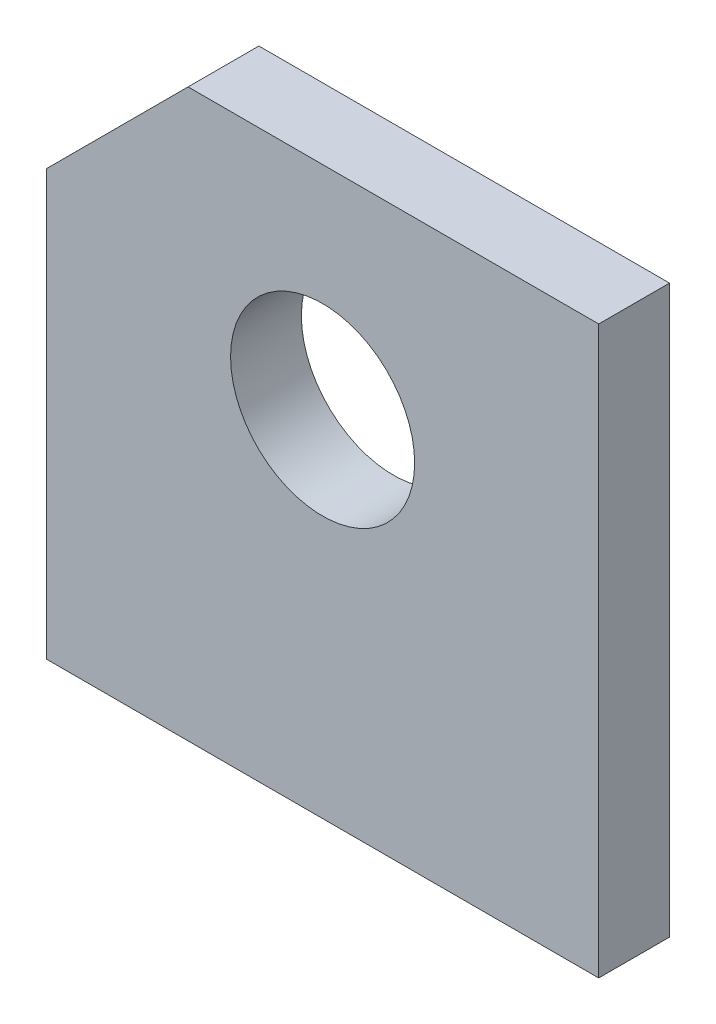
ISO-10303-21;
HEADER;
FILE_DESCRIPTION(('STEP AP214'),'2;1');
FILE_NAME('part.step','',(''),(''),'','','');
FILE_SCHEMA(('AUTOMOTIVE_DESIGN { 1 0 10303 214 1 1 1 1 }'));
ENDSEC;
DATA;
#1=APPLICATION_CONTEXT('core data for automotive mechanical design processes');
#2=APPLICATION_PROTOCOL_DEFINITION('international standard','automotive_design',2000,#1);
#3=PRODUCT_CONTEXT('',#1,'mechanical');
#4=PRODUCT('Part','Part','',(#3));
#5=PRODUCT_RELATED_PRODUCT_CATEGORY('part','',(#4));
#6=PRODUCT_DEFINITION_FORMATION('','',#4);
#7=PRODUCT_DEFINITION_CONTEXT('part definition',#1,'design');
#8=PRODUCT_DEFINITION('design','',#6,#7);
#9=PRODUCT_DEFINITION_SHAPE('','',#8);
#10=(LENGTH_UNIT() NAMED_UNIT(*) SI_UNIT(.MILLI.,.METRE.));
#11=(NAMED_UNIT(*) PLANE_ANGLE_UNIT() SI_UNIT($,.RADIAN.));
#12=(NAMED_UNIT(*) SI_UNIT($,.STERADIAN.) SOLID_ANGLE_UNIT());
#13=UNCERTAINTY_MEASURE_WITH_UNIT(LENGTH_MEASURE(1.E-05),#10,'distance_accuracy_value','');
#14=(GEOMETRIC_REPRESENTATION_CONTEXT(3) GLOBAL_UNCERTAINTY_ASSIGNED_CONTEXT((#13)) GLOBAL_UNIT_ASSIGNED_CONTEXT((#10,
#11,#12)) REPRESENTATION_CONTEXT('',''));
#15=CARTESIAN_POINT('',(0.,0.,0.));
#16=DIRECTION('',(0.,0.,1.));
#17=DIRECTION('',(1.,0.,0.));
#18=AXIS2_PLACEMENT_3D('',#15,#16,#17);
#19=CARTESIAN_POINT('',(0.,0.,2.54));
#20=DIRECTION('',(0.,0.,-1.));
#21=DIRECTION('',(-1.,0.,0.));
#22=AXIS2_PLACEMENT_3D('',#19,#20,#21);
#23=PLANE('',#22);
#24=DIRECTION('',(0.,-1.,0.));
#25=VECTOR('',#24,1.);
#26=CARTESIAN_POINT('',(0.,0.,2.54));
#27=LINE('',#26,#25);
#28=CARTESIAN_POINT('',(0.,15.24,2.54));
#29=VERTEX_POINT('',#28);
#30=CARTESIAN_POINT('',(0.,0.,2.54));
#31=VERTEX_POINT('',#30);
#32=EDGE_CURVE('E121',#29,#31,#27,.T.);
#33=ORIENTED_EDGE('',*,*,#32,.T.);
#34=DIRECTION('',(1.,0.,0.));
#35=VECTOR('',#34,1.);
#36=CARTESIAN_POINT('',(0.,0.,2.54));
#37=LINE('',#36,#35);
#38=CARTESIAN_POINT('',(19.812,0.,2.54));
#39=VERTEX_POINT('',#38);
#40=EDGE_CURVE('E88',#31,#39,#37,.T.);
#41=ORIENTED_EDGE('',*,*,#40,.T.);
#42=DIRECTION('',(0.,1.,0.));
#43=VECTOR('',#42,1.);
#44=CARTESIAN_POINT('',(19.812,0.,2.54));
#45=LINE('',#44,#43);
#46=CARTESIAN_POINT('',(19.812,20.32,2.54));
#47=VERTEX_POINT('',#46);
#48=EDGE_CURVE('E92',#39,#47,#45,.T.);
#49=ORIENTED_EDGE('',*,*,#48,.T.);
#50=DIRECTION('',(-1.,0.,0.));
#51=VECTOR('',#50,1.);
#52=CARTESIAN_POINT('',(5.08,20.32,2.54));
#53=LINE('',#52,#51);
#54=CARTESIAN_POINT('',(5.08,20.32,2.54));
#55=VERTEX_POINT('',#54);
#56=EDGE_CURVE('E96',#47,#55,#53,.T.);
#57=ORIENTED_EDGE('',*,*,#56,.T.);
#58=DIRECTION('',(-0.707106781186547,-0.707106781186548,0.));
#59=VECTOR('',#58,1.);
#60=CARTESIAN_POINT('',(0.,15.24,2.54));
#61=LINE('',#60,#59);
#62=EDGE_CURVE('E54',#55,#29,#61,.T.);
#63=ORIENTED_EDGE('',*,*,#62,.T.);
#64=EDGE_LOOP('',(#33,#41,#49,#57,#63));
#65=FACE_BOUND('',#64,.T.);
#66=CARTESIAN_POINT('',(9.906,12.7,2.54));
#67=DIRECTION('',(0.,0.,1.));
#68=DIRECTION('',(1.,0.,0.));
#69=AXIS2_PLACEMENT_3D('',#66,#67,#68);
#70=CIRCLE('',#69,3.302);
#71=CARTESIAN_POINT('',(13.208,12.7,2.54));
#72=VERTEX_POINT('',#71);
#73=EDGE_CURVE('E116',#72,#72,#70,.T.);
#74=ORIENTED_EDGE('',*,*,#73,.F.);
#75=EDGE_LOOP('',(#74));
#76=FACE_BOUND('',#75,.T.);
#77=ADVANCED_FACE('F37',(#65,#76),#23,.F.);
#78=CARTESIAN_POINT('',(0.,0.,0.));
#79=DIRECTION('',(0.,0.,-1.));
#80=DIRECTION('',(-1.,0.,0.));
#81=AXIS2_PLACEMENT_3D('',#78,#79,#80);
#82=PLANE('',#81);
#83=DIRECTION('',(0.,-1.,0.));
#84=VECTOR('',#83,1.);
#85=CARTESIAN_POINT('',(0.,0.,0.));
#86=LINE('',#85,#84);
#87=CARTESIAN_POINT('',(0.,15.24,0.));
#88=VERTEX_POINT('',#87);
#89=CARTESIAN_POINT('',(0.,0.,0.));
#90=VERTEX_POINT('',#89);
#91=EDGE_CURVE('E112',#88,#90,#86,.T.);
#92=ORIENTED_EDGE('',*,*,#91,.F.);
#93=DIRECTION('',(-0.707106781186547,-0.707106781186548,0.));
#94=VECTOR('',#93,1.);
#95=CARTESIAN_POINT('',(0.,15.24,0.));
#96=LINE('',#95,#94);
#97=CARTESIAN_POINT('',(5.08,20.32,0.));
#98=VERTEX_POINT('',#97);
#99=EDGE_CURVE('E80',#98,#88,#96,.T.);
#100=ORIENTED_EDGE('',*,*,#99,.F.);
#101=DIRECTION('',(-1.,0.,0.));
#102=VECTOR('',#101,1.);
#103=CARTESIAN_POINT('',(5.08,20.32,0.));
#104=LINE('',#103,#102);
#105=CARTESIAN_POINT('',(19.812,20.32,0.));
#106=VERTEX_POINT('',#105);
#107=EDGE_CURVE('E74',#106,#98,#104,.T.);
#108=ORIENTED_EDGE('',*,*,#107,.F.);
#109=DIRECTION('',(0.,1.,0.));
#110=VECTOR('',#109,1.);
#111=CARTESIAN_POINT('',(19.812,0.,0.));
#112=LINE('',#111,#110);
#113=CARTESIAN_POINT('',(19.812,0.,0.));
#114=VERTEX_POINT('',#113);
#115=EDGE_CURVE('E103',#114,#106,#112,.T.);
#116=ORIENTED_EDGE('',*,*,#115,.F.);
#117=DIRECTION('',(1.,0.,0.));
#118=VECTOR('',#117,1.);
#119=CARTESIAN_POINT('',(0.,0.,0.));
#120=LINE('',#119,#118);
#121=EDGE_CURVE('E115',#90,#114,#120,.T.);
#122=ORIENTED_EDGE('',*,*,#121,.F.);
#123=EDGE_LOOP('',(#92,#100,#108,#116,#122));
#124=FACE_BOUND('',#123,.T.);
#125=CARTESIAN_POINT('',(9.906,12.7,0.));
#126=DIRECTION('',(0.,0.,1.));
#127=DIRECTION('',(1.,0.,0.));
#128=AXIS2_PLACEMENT_3D('',#125,#126,#127);
#129=CIRCLE('',#128,3.302);
#130=CARTESIAN_POINT('',(13.208,12.7,0.));
#131=VERTEX_POINT('',#130);
#132=EDGE_CURVE('E201',#131,#131,#129,.T.);
#133=ORIENTED_EDGE('',*,*,#132,.T.);
#134=EDGE_LOOP('',(#133));
#135=FACE_BOUND('',#134,.T.);
#136=ADVANCED_FACE('F125',(#124,#135),#82,.T.);
#137=CARTESIAN_POINT('',(0.,0.,2.54));
#138=DIRECTION('',(1.,0.,0.));
#139=DIRECTION('',(0.,0.,-1.));
#140=AXIS2_PLACEMENT_3D('',#137,#138,#139);
#141=PLANE('',#140);
#142=ORIENTED_EDGE('',*,*,#91,.T.);
#143=DIRECTION('',(0.,0.,-1.));
#144=VECTOR('',#143,1.);
#145=CARTESIAN_POINT('',(0.,0.,2.54));
#146=LINE('',#145,#144);
#147=EDGE_CURVE('E11',#31,#90,#146,.T.);
#148=ORIENTED_EDGE('',*,*,#147,.F.);
#149=ORIENTED_EDGE('',*,*,#32,.F.);
#150=DIRECTION('',(0.,0.,-1.));
#151=VECTOR('',#150,1.);
#152=CARTESIAN_POINT('',(0.,15.24,2.54));
#153=LINE('',#152,#151);
#154=EDGE_CURVE('E108',#29,#88,#153,.T.);
#155=ORIENTED_EDGE('',*,*,#154,.T.);
#156=EDGE_LOOP('',(#142,#148,#149,#155));
#157=FACE_BOUND('',#156,.T.);
#158=ADVANCED_FACE('F39',(#157),#141,.F.);
#159=CARTESIAN_POINT('',(0.,0.,2.54));
#160=DIRECTION('',(0.,1.,0.));
#161=DIRECTION('',(0.,0.,1.));
#162=AXIS2_PLACEMENT_3D('',#159,#160,#161);
#163=PLANE('',#162);
#164=ORIENTED_EDGE('',*,*,#121,.T.);
#165=DIRECTION('',(0.,0.,-1.));
#166=VECTOR('',#165,1.);
#167=CARTESIAN_POINT('',(19.812,0.,2.54));
#168=LINE('',#167,#166);
#169=EDGE_CURVE('E46',#39,#114,#168,.T.);
#170=ORIENTED_EDGE('',*,*,#169,.F.);
#171=ORIENTED_EDGE('',*,*,#40,.F.);
#172=ORIENTED_EDGE('',*,*,#147,.T.);
#173=EDGE_LOOP('',(#164,#170,#171,#172));
#174=FACE_BOUND('',#173,.T.);
#175=ADVANCED_FACE('F150',(#174),#163,.F.);
#176=CARTESIAN_POINT('',(19.812,0.,2.54));
#177=DIRECTION('',(-1.,0.,0.));
#178=DIRECTION('',(0.,0.,1.));
#179=AXIS2_PLACEMENT_3D('',#176,#177,#178);
#180=PLANE('',#179);
#181=ORIENTED_EDGE('',*,*,#115,.T.);
#182=DIRECTION('',(0.,0.,-1.));
#183=VECTOR('',#182,1.);
#184=CARTESIAN_POINT('',(19.812,20.32,2.54));
#185=LINE('',#184,#183);
#186=EDGE_CURVE('E100',#47,#106,#185,.T.);
#187=ORIENTED_EDGE('',*,*,#186,.F.);
#188=ORIENTED_EDGE('',*,*,#48,.F.);
#189=ORIENTED_EDGE('',*,*,#169,.T.);
#190=EDGE_LOOP('',(#181,#187,#188,#189));
#191=FACE_BOUND('',#190,.T.);
#192=ADVANCED_FACE('F101',(#191),#180,.F.);
#193=CARTESIAN_POINT('',(5.08,20.32,2.54));
#194=DIRECTION('',(0.,-1.,0.));
#195=DIRECTION('',(0.,0.,-1.));
#196=AXIS2_PLACEMENT_3D('',#193,#194,#195);
#197=PLANE('',#196);
#198=ORIENTED_EDGE('',*,*,#107,.T.);
#199=DIRECTION('',(0.,0.,-1.));
#200=VECTOR('',#199,1.);
#201=CARTESIAN_POINT('',(5.08,20.32,2.54));
#202=LINE('',#201,#200);
#203=EDGE_CURVE('E104',#55,#98,#202,.T.);
#204=ORIENTED_EDGE('',*,*,#203,.F.);
#205=ORIENTED_EDGE('',*,*,#56,.F.);
#206=ORIENTED_EDGE('',*,*,#186,.T.);
#207=EDGE_LOOP('',(#198,#204,#205,#206));
#208=FACE_BOUND('',#207,.T.);
#209=ADVANCED_FACE('F106',(#208),#197,.F.);
#210=CARTESIAN_POINT('',(0.,15.24,2.54));
#211=DIRECTION('',(0.707106781186548,-0.707106781186547,0.));
#212=DIRECTION('',(0.707106781186547,0.707106781186548,0.));
#213=AXIS2_PLACEMENT_3D('',#210,#211,#212);
#214=PLANE('',#213);
#215=ORIENTED_EDGE('',*,*,#99,.T.);
#216=ORIENTED_EDGE('',*,*,#154,.F.);
#217=ORIENTED_EDGE('',*,*,#62,.F.);
#218=ORIENTED_EDGE('',*,*,#203,.T.);
#219=EDGE_LOOP('',(#215,#216,#217,#218));
#220=FACE_BOUND('',#219,.T.);
#221=ADVANCED_FACE('F130',(#220),#214,.F.);
#222=CARTESIAN_POINT('',(9.906,12.7,2.54));
#223=DIRECTION('',(0.,0.,-1.));
#224=DIRECTION('',(-1.,0.,0.));
#225=AXIS2_PLACEMENT_3D('',#222,#223,#224);
#226=CYLINDRICAL_SURFACE('',#225,3.302);
#227=ORIENTED_EDGE('',*,*,#73,.T.);
#228=EDGE_LOOP('',(#227));
#229=FACE_BOUND('',#228,.T.);
#230=ORIENTED_EDGE('',*,*,#132,.F.);
#231=EDGE_LOOP('',(#230));
#232=FACE_BOUND('',#231,.T.);
#233=ADVANCED_FACE('F132',(#229,#232),#226,.F.);
#234=CLOSED_SHELL('',(#77,#136,#158,#175,#192,#209,#221,#233));
#235=MANIFOLD_SOLID_BREP('B2',#234);
#236=ADVANCED_BREP_SHAPE_REPRESENTATION('',(#18,#235),#14);
#237=SHAPE_DEFINITION_REPRESENTATION(#9,#236);
ENDSEC;
END-ISO-10303-21;
